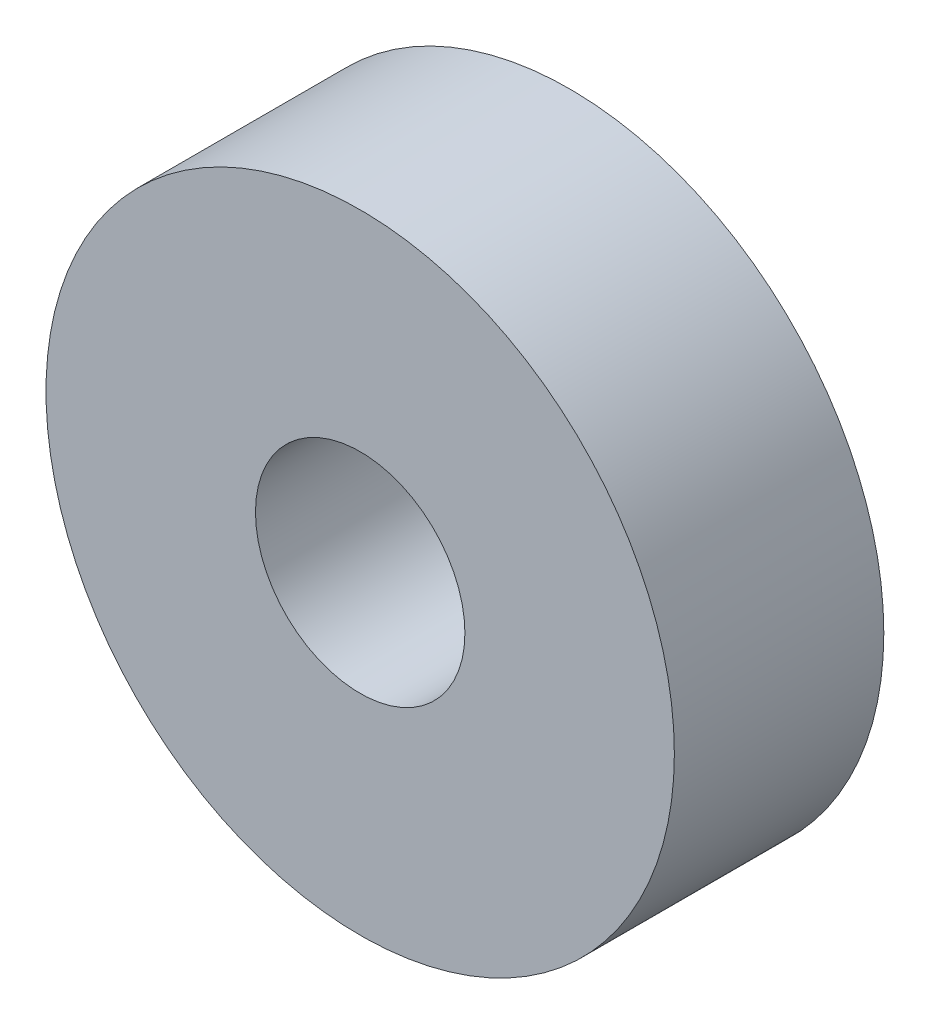
ISO-10303-21;
HEADER;
FILE_DESCRIPTION(('STEP AP214'),'2;1');
FILE_NAME('part.step','',(''),(''),'','','');
FILE_SCHEMA(('AUTOMOTIVE_DESIGN { 1 0 10303 214 1 1 1 1 }'));
ENDSEC;
DATA;
#1=APPLICATION_CONTEXT('core data for automotive mechanical design processes');
#2=APPLICATION_PROTOCOL_DEFINITION('international standard','automotive_design',2000,#1);
#3=PRODUCT_CONTEXT('',#1,'mechanical');
#4=PRODUCT('Part','Part','',(#3));
#5=PRODUCT_RELATED_PRODUCT_CATEGORY('part','',(#4));
#6=PRODUCT_DEFINITION_FORMATION('','',#4);
#7=PRODUCT_DEFINITION_CONTEXT('part definition',#1,'design');
#8=PRODUCT_DEFINITION('design','',#6,#7);
#9=PRODUCT_DEFINITION_SHAPE('','',#8);
#10=(LENGTH_UNIT() NAMED_UNIT(*) SI_UNIT(.MILLI.,.METRE.));
#11=(NAMED_UNIT(*) PLANE_ANGLE_UNIT() SI_UNIT($,.RADIAN.));
#12=(NAMED_UNIT(*) SI_UNIT($,.STERADIAN.) SOLID_ANGLE_UNIT());
#13=UNCERTAINTY_MEASURE_WITH_UNIT(LENGTH_MEASURE(1.E-05),#10,'distance_accuracy_value','');
#14=(GEOMETRIC_REPRESENTATION_CONTEXT(3) GLOBAL_UNCERTAINTY_ASSIGNED_CONTEXT((#13)) GLOBAL_UNIT_ASSIGNED_CONTEXT((#10,
#11,#12)) REPRESENTATION_CONTEXT('',''));
#15=CARTESIAN_POINT('',(0.,0.,0.));
#16=DIRECTION('',(0.,0.,1.));
#17=DIRECTION('',(1.,0.,0.));
#18=AXIS2_PLACEMENT_3D('',#15,#16,#17);
#19=CARTESIAN_POINT('',(0.,0.,4.));
#20=DIRECTION('',(0.,0.,1.));
#21=DIRECTION('',(1.,0.,0.));
#22=AXIS2_PLACEMENT_3D('',#19,#20,#21);
#23=PLANE('',#22);
#24=CARTESIAN_POINT('',(0.,0.,4.));
#25=DIRECTION('',(0.,0.,1.));
#26=DIRECTION('',(1.,0.,0.));
#27=AXIS2_PLACEMENT_3D('',#24,#25,#26);
#28=CIRCLE('',#27,6.);
#29=CARTESIAN_POINT('',(6.,0.,4.));
#30=VERTEX_POINT('',#29);
#31=EDGE_CURVE('E10',#30,#30,#28,.T.);
#32=ORIENTED_EDGE('',*,*,#31,.T.);
#33=EDGE_LOOP('',(#32));
#34=FACE_BOUND('',#33,.T.);
#35=CARTESIAN_POINT('',(0.,0.,4.));
#36=DIRECTION('',(0.,0.,1.));
#37=DIRECTION('',(1.,0.,0.));
#38=AXIS2_PLACEMENT_3D('',#35,#36,#37);
#39=CIRCLE('',#38,2.);
#40=CARTESIAN_POINT('',(2.,0.,4.));
#41=VERTEX_POINT('',#40);
#42=EDGE_CURVE('E43',#41,#41,#39,.T.);
#43=ORIENTED_EDGE('',*,*,#42,.F.);
#44=EDGE_LOOP('',(#43));
#45=FACE_BOUND('',#44,.T.);
#46=ADVANCED_FACE('F32',(#34,#45),#23,.T.);
#47=CARTESIAN_POINT('',(0.,0.,0.));
#48=DIRECTION('',(0.,0.,1.));
#49=DIRECTION('',(1.,0.,0.));
#50=AXIS2_PLACEMENT_3D('',#47,#48,#49);
#51=PLANE('',#50);
#52=CARTESIAN_POINT('',(0.,0.,0.));
#53=DIRECTION('',(0.,0.,1.));
#54=DIRECTION('',(1.,0.,0.));
#55=AXIS2_PLACEMENT_3D('',#52,#53,#54);
#56=CIRCLE('',#55,6.);
#57=CARTESIAN_POINT('',(6.,0.,0.));
#58=VERTEX_POINT('',#57);
#59=EDGE_CURVE('E36',#58,#58,#56,.T.);
#60=ORIENTED_EDGE('',*,*,#59,.F.);
#61=EDGE_LOOP('',(#60));
#62=FACE_BOUND('',#61,.T.);
#63=CARTESIAN_POINT('',(0.,0.,0.));
#64=DIRECTION('',(0.,0.,1.));
#65=DIRECTION('',(1.,0.,0.));
#66=AXIS2_PLACEMENT_3D('',#63,#64,#65);
#67=CIRCLE('',#66,2.);
#68=CARTESIAN_POINT('',(2.,0.,0.));
#69=VERTEX_POINT('',#68);
#70=EDGE_CURVE('E45',#69,#69,#67,.T.);
#71=ORIENTED_EDGE('',*,*,#70,.T.);
#72=EDGE_LOOP('',(#71));
#73=FACE_BOUND('',#72,.T.);
#74=ADVANCED_FACE('F55',(#62,#73),#51,.F.);
#75=CARTESIAN_POINT('',(0.,0.,4.));
#76=DIRECTION('',(0.,0.,-1.));
#77=DIRECTION('',(-1.,0.,0.));
#78=AXIS2_PLACEMENT_3D('',#75,#76,#77);
#79=CYLINDRICAL_SURFACE('',#78,6.);
#80=ORIENTED_EDGE('',*,*,#31,.F.);
#81=EDGE_LOOP('',(#80));
#82=FACE_BOUND('',#81,.T.);
#83=ORIENTED_EDGE('',*,*,#59,.T.);
#84=EDGE_LOOP('',(#83));
#85=FACE_BOUND('',#84,.T.);
#86=ADVANCED_FACE('F34',(#82,#85),#79,.T.);
#87=CARTESIAN_POINT('',(0.,0.,4.));
#88=DIRECTION('',(0.,0.,-1.));
#89=DIRECTION('',(-1.,0.,0.));
#90=AXIS2_PLACEMENT_3D('',#87,#88,#89);
#91=CYLINDRICAL_SURFACE('',#90,2.);
#92=ORIENTED_EDGE('',*,*,#42,.T.);
#93=EDGE_LOOP('',(#92));
#94=FACE_BOUND('',#93,.T.);
#95=ORIENTED_EDGE('',*,*,#70,.F.);
#96=EDGE_LOOP('',(#95));
#97=FACE_BOUND('',#96,.T.);
#98=ADVANCED_FACE('F51',(#94,#97),#91,.F.);
#99=CLOSED_SHELL('',(#46,#74,#86,#98));
#100=MANIFOLD_SOLID_BREP('B2',#99);
#101=ADVANCED_BREP_SHAPE_REPRESENTATION('',(#18,#100),#14);
#102=SHAPE_DEFINITION_REPRESENTATION(#9,#101);
ENDSEC;
END-ISO-10303-21;
